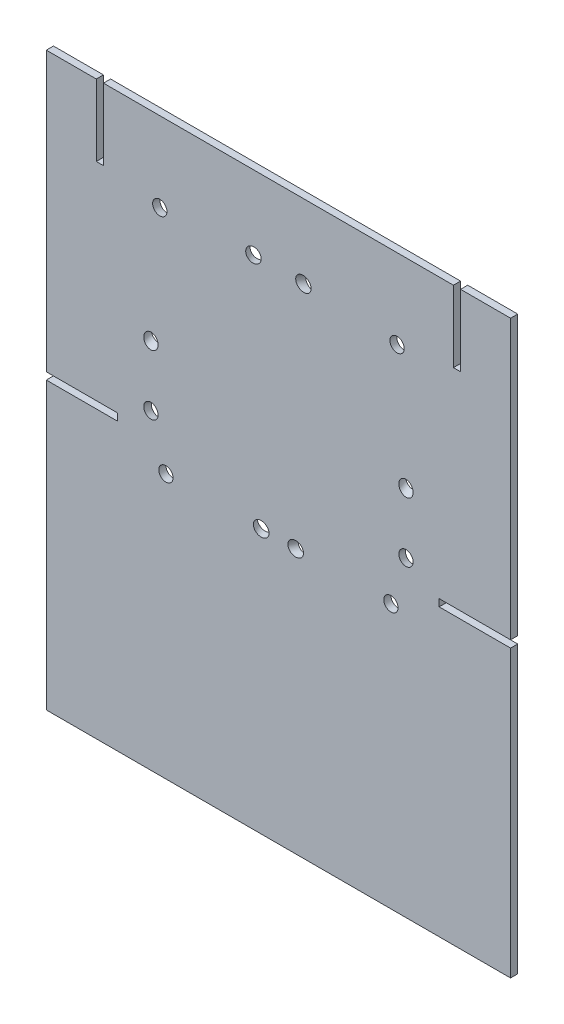
ISO-10303-21;
HEADER;
FILE_DESCRIPTION(('STEP AP214'),'2;1');
FILE_NAME('part.step','',(''),(''),'','','');
FILE_SCHEMA(('AUTOMOTIVE_DESIGN { 1 0 10303 214 1 1 1 1 }'));
ENDSEC;
DATA;
#1=APPLICATION_CONTEXT('core data for automotive mechanical design processes');
#2=APPLICATION_PROTOCOL_DEFINITION('international standard','automotive_design',2000,#1);
#3=PRODUCT_CONTEXT('',#1,'mechanical');
#4=PRODUCT('Part','Part','',(#3));
#5=PRODUCT_RELATED_PRODUCT_CATEGORY('part','',(#4));
#6=PRODUCT_DEFINITION_FORMATION('','',#4);
#7=PRODUCT_DEFINITION_CONTEXT('part definition',#1,'design');
#8=PRODUCT_DEFINITION('design','',#6,#7);
#9=PRODUCT_DEFINITION_SHAPE('','',#8);
#10=(LENGTH_UNIT() NAMED_UNIT(*) SI_UNIT(.MILLI.,.METRE.));
#11=(NAMED_UNIT(*) PLANE_ANGLE_UNIT() SI_UNIT($,.RADIAN.));
#12=(NAMED_UNIT(*) SI_UNIT($,.STERADIAN.) SOLID_ANGLE_UNIT());
#13=UNCERTAINTY_MEASURE_WITH_UNIT(LENGTH_MEASURE(1.E-05),#10,'distance_accuracy_value','');
#14=(GEOMETRIC_REPRESENTATION_CONTEXT(3) GLOBAL_UNCERTAINTY_ASSIGNED_CONTEXT((#13)) GLOBAL_UNIT_ASSIGNED_CONTEXT((#10,
#11,#12)) REPRESENTATION_CONTEXT('',''));
#15=CARTESIAN_POINT('',(0.,0.,0.));
#16=DIRECTION('',(0.,0.,1.));
#17=DIRECTION('',(1.,0.,0.));
#18=AXIS2_PLACEMENT_3D('',#15,#16,#17);
#19=CARTESIAN_POINT('',(-412.75,508.,6.35));
#20=DIRECTION('',(0.,-1.,0.));
#21=DIRECTION('',(1.,0.,0.));
#22=AXIS2_PLACEMENT_3D('',#19,#20,#21);
#23=PLANE('',#22);
#24=DIRECTION('',(-1.,0.,0.));
#25=VECTOR('',#24,1.);
#26=CARTESIAN_POINT('',(-412.75,508.,-6.35));
#27=LINE('',#26,#25);
#28=CARTESIAN_POINT('',(311.150000000003,507.999999999998,-6.35));
#29=VERTEX_POINT('',#28);
#30=CARTESIAN_POINT('',(-311.15,508.,-6.35));
#31=VERTEX_POINT('',#30);
#32=EDGE_CURVE('E414',#29,#31,#27,.T.);
#33=ORIENTED_EDGE('',*,*,#32,.T.);
#34=DIRECTION('',(0.,0.,-1.));
#35=VECTOR('',#34,1.);
#36=CARTESIAN_POINT('',(-311.15,508.,6.35000000000002));
#37=LINE('',#36,#35);
#38=CARTESIAN_POINT('',(-311.15,508.,6.35000000000002));
#39=VERTEX_POINT('',#38);
#40=EDGE_CURVE('E225',#39,#31,#37,.T.);
#41=ORIENTED_EDGE('',*,*,#40,.F.);
#42=DIRECTION('',(-1.,0.,0.));
#43=VECTOR('',#42,1.);
#44=CARTESIAN_POINT('',(-412.75,508.,6.35));
#45=LINE('',#44,#43);
#46=CARTESIAN_POINT('',(311.150000000003,507.999999999998,6.35000000000002));
#47=VERTEX_POINT('',#46);
#48=EDGE_CURVE('E211',#47,#39,#45,.T.);
#49=ORIENTED_EDGE('',*,*,#48,.F.);
#50=DIRECTION('',(0.,0.,-1.));
#51=VECTOR('',#50,1.);
#52=CARTESIAN_POINT('',(311.150000000003,507.999999999998,6.35000000000002));
#53=LINE('',#52,#51);
#54=EDGE_CURVE('E234',#47,#29,#53,.T.);
#55=ORIENTED_EDGE('',*,*,#54,.T.);
#56=EDGE_LOOP('',(#33,#41,#49,#55));
#57=FACE_BOUND('',#56,.T.);
#58=ADVANCED_FACE('F45',(#57),#23,.F.);
#59=CARTESIAN_POINT('',(-323.85,508.,6.35000000000002));
#60=VERTEX_POINT('',#59);
#61=CARTESIAN_POINT('',(-412.75,508.,6.35));
#62=VERTEX_POINT('',#61);
#63=EDGE_CURVE('E429',#60,#62,#45,.T.);
#64=ORIENTED_EDGE('',*,*,#63,.F.);
#65=DIRECTION('',(0.,0.,-1.));
#66=VECTOR('',#65,1.);
#67=CARTESIAN_POINT('',(-323.85,508.,6.35000000000002));
#68=LINE('',#67,#66);
#69=CARTESIAN_POINT('',(-323.85,508.,-6.35));
#70=VERTEX_POINT('',#69);
#71=EDGE_CURVE('E229',#60,#70,#68,.T.);
#72=ORIENTED_EDGE('',*,*,#71,.T.);
#73=CARTESIAN_POINT('',(-412.75,508.,-6.35));
#74=VERTEX_POINT('',#73);
#75=EDGE_CURVE('E404',#70,#74,#27,.T.);
#76=ORIENTED_EDGE('',*,*,#75,.T.);
#77=DIRECTION('',(0.,0.,-1.));
#78=VECTOR('',#77,1.);
#79=CARTESIAN_POINT('',(-412.75,508.,6.35));
#80=LINE('',#79,#78);
#81=EDGE_CURVE('E390',#62,#74,#80,.T.);
#82=ORIENTED_EDGE('',*,*,#81,.F.);
#83=EDGE_LOOP('',(#64,#72,#76,#82));
#84=FACE_BOUND('',#83,.T.);
#85=ADVANCED_FACE('F575',(#84),#23,.F.);
#86=CARTESIAN_POINT('',(412.75,508.,6.35));
#87=DIRECTION('',(-1.,0.,0.));
#88=DIRECTION('',(0.,-1.,0.));
#89=AXIS2_PLACEMENT_3D('',#86,#87,#88);
#90=PLANE('',#89);
#91=DIRECTION('',(0.,0.,-1.));
#92=VECTOR('',#91,1.);
#93=CARTESIAN_POINT('',(412.75,12.6999999999955,6.35000000000002));
#94=LINE('',#93,#92);
#95=CARTESIAN_POINT('',(412.75,12.6999999999955,6.35000000000002));
#96=VERTEX_POINT('',#95);
#97=CARTESIAN_POINT('',(412.75,12.6999999999955,-6.35));
#98=VERTEX_POINT('',#97);
#99=EDGE_CURVE('E228',#96,#98,#94,.T.);
#100=ORIENTED_EDGE('',*,*,#99,.T.);
#101=DIRECTION('',(0.,1.,0.));
#102=VECTOR('',#101,1.);
#103=CARTESIAN_POINT('',(412.75,508.,-6.35));
#104=LINE('',#103,#102);
#105=CARTESIAN_POINT('',(412.75,508.,-6.35));
#106=VERTEX_POINT('',#105);
#107=EDGE_CURVE('E303',#98,#106,#104,.T.);
#108=ORIENTED_EDGE('',*,*,#107,.T.);
#109=DIRECTION('',(0.,0.,-1.));
#110=VECTOR('',#109,1.);
#111=CARTESIAN_POINT('',(412.75,508.,6.35));
#112=LINE('',#111,#110);
#113=CARTESIAN_POINT('',(412.75,508.,6.35));
#114=VERTEX_POINT('',#113);
#115=EDGE_CURVE('E384',#114,#106,#112,.T.);
#116=ORIENTED_EDGE('',*,*,#115,.F.);
#117=DIRECTION('',(0.,1.,0.));
#118=VECTOR('',#117,1.);
#119=CARTESIAN_POINT('',(412.75,508.,6.35));
#120=LINE('',#119,#118);
#121=EDGE_CURVE('E434',#96,#114,#120,.T.);
#122=ORIENTED_EDGE('',*,*,#121,.F.);
#123=EDGE_LOOP('',(#100,#108,#116,#122));
#124=FACE_BOUND('',#123,.T.);
#125=ADVANCED_FACE('F531',(#124),#90,.F.);
#126=CARTESIAN_POINT('',(-412.75,508.,6.35));
#127=DIRECTION('',(1.,0.,0.));
#128=DIRECTION('',(0.,1.,0.));
#129=AXIS2_PLACEMENT_3D('',#126,#127,#128);
#130=PLANE('',#129);
#131=DIRECTION('',(0.,0.,-1.));
#132=VECTOR('',#131,1.);
#133=CARTESIAN_POINT('',(-412.75,2.22044604925031E-13,6.35000000000002));
#134=LINE('',#133,#132);
#135=CARTESIAN_POINT('',(-412.75,2.22044604925031E-13,6.35000000000002));
#136=VERTEX_POINT('',#135);
#137=CARTESIAN_POINT('',(-412.75,2.22044604925031E-13,-6.35));
#138=VERTEX_POINT('',#137);
#139=EDGE_CURVE('E299',#136,#138,#134,.T.);
#140=ORIENTED_EDGE('',*,*,#139,.T.);
#141=DIRECTION('',(0.,-1.,0.));
#142=VECTOR('',#141,1.);
#143=CARTESIAN_POINT('',(-412.75,508.,-6.35));
#144=LINE('',#143,#142);
#145=CARTESIAN_POINT('',(-412.75,-508.,-6.35));
#146=VERTEX_POINT('',#145);
#147=EDGE_CURVE('E388',#138,#146,#144,.T.);
#148=ORIENTED_EDGE('',*,*,#147,.T.);
#149=DIRECTION('',(0.,0.,-1.));
#150=VECTOR('',#149,1.);
#151=CARTESIAN_POINT('',(-412.75,-508.,6.35));
#152=LINE('',#151,#150);
#153=CARTESIAN_POINT('',(-412.75,-508.,6.35));
#154=VERTEX_POINT('',#153);
#155=EDGE_CURVE('E396',#154,#146,#152,.T.);
#156=ORIENTED_EDGE('',*,*,#155,.F.);
#157=DIRECTION('',(0.,-1.,0.));
#158=VECTOR('',#157,1.);
#159=CARTESIAN_POINT('',(-412.75,508.,6.35));
#160=LINE('',#159,#158);
#161=EDGE_CURVE('E424',#136,#154,#160,.T.);
#162=ORIENTED_EDGE('',*,*,#161,.F.);
#163=EDGE_LOOP('',(#140,#148,#156,#162));
#164=FACE_BOUND('',#163,.T.);
#165=ADVANCED_FACE('F567',(#164),#130,.F.);
#166=CARTESIAN_POINT('',(0.,0.,6.35));
#167=DIRECTION('',(0.,0.,1.));
#168=DIRECTION('',(1.,0.,0.));
#169=AXIS2_PLACEMENT_3D('',#166,#167,#168);
#170=PLANE('',#169);
#171=DIRECTION('',(0.,-1.,0.));
#172=VECTOR('',#171,1.);
#173=CARTESIAN_POINT('',(-311.15,508.,6.35000000000002));
#174=LINE('',#173,#172);
#175=CARTESIAN_POINT('',(-311.15,381.,6.35000000000002));
#176=VERTEX_POINT('',#175);
#177=EDGE_CURVE('E188',#39,#176,#174,.T.);
#178=ORIENTED_EDGE('',*,*,#177,.T.);
#179=DIRECTION('',(-1.,0.,0.));
#180=VECTOR('',#179,1.);
#181=CARTESIAN_POINT('',(-311.15,381.,6.35000000000002));
#182=LINE('',#181,#180);
#183=CARTESIAN_POINT('',(-323.85,381.,6.35000000000002));
#184=VERTEX_POINT('',#183);
#185=EDGE_CURVE('E200',#176,#184,#182,.T.);
#186=ORIENTED_EDGE('',*,*,#185,.T.);
#187=DIRECTION('',(0.,1.,0.));
#188=VECTOR('',#187,1.);
#189=CARTESIAN_POINT('',(-323.85,508.,6.35000000000002));
#190=LINE('',#189,#188);
#191=EDGE_CURVE('E197',#184,#60,#190,.T.);
#192=ORIENTED_EDGE('',*,*,#191,.T.);
#193=ORIENTED_EDGE('',*,*,#63,.T.);
#194=CARTESIAN_POINT('',(-412.75,12.6999999999982,6.35000000000002));
#195=VERTEX_POINT('',#194);
#196=EDGE_CURVE('E420',#62,#195,#160,.T.);
#197=ORIENTED_EDGE('',*,*,#196,.T.);
#198=DIRECTION('',(1.,0.,0.));
#199=VECTOR('',#198,1.);
#200=CARTESIAN_POINT('',(-412.75,12.6999999999982,6.35000000000002));
#201=LINE('',#200,#199);
#202=CARTESIAN_POINT('',(-285.75,12.6999999999982,6.35000000000002));
#203=VERTEX_POINT('',#202);
#204=EDGE_CURVE('E274',#195,#203,#201,.T.);
#205=ORIENTED_EDGE('',*,*,#204,.T.);
#206=DIRECTION('',(0.,-1.,0.));
#207=VECTOR('',#206,1.);
#208=CARTESIAN_POINT('',(-285.75,12.6999999999982,6.35000000000002));
#209=LINE('',#208,#207);
#210=CARTESIAN_POINT('',(-285.75,0.,6.35000000000002));
#211=VERTEX_POINT('',#210);
#212=EDGE_CURVE('E269',#203,#211,#209,.T.);
#213=ORIENTED_EDGE('',*,*,#212,.T.);
#214=DIRECTION('',(1.,0.,0.));
#215=VECTOR('',#214,1.);
#216=CARTESIAN_POINT('',(-412.75,2.22044604925031E-13,6.35000000000002));
#217=LINE('',#216,#215);
#218=EDGE_CURVE('E266',#136,#211,#217,.T.);
#219=ORIENTED_EDGE('',*,*,#218,.F.);
#220=ORIENTED_EDGE('',*,*,#161,.T.);
#221=DIRECTION('',(1.,0.,0.));
#222=VECTOR('',#221,1.);
#223=CARTESIAN_POINT('',(-412.75,-508.,6.35));
#224=LINE('',#223,#222);
#225=CARTESIAN_POINT('',(412.75,-508.,6.35));
#226=VERTEX_POINT('',#225);
#227=EDGE_CURVE('E383',#154,#226,#224,.T.);
#228=ORIENTED_EDGE('',*,*,#227,.T.);
#229=CARTESIAN_POINT('',(412.75,-2.66453525910038E-12,6.35000000000002));
#230=VERTEX_POINT('',#229);
#231=EDGE_CURVE('E430',#226,#230,#120,.T.);
#232=ORIENTED_EDGE('',*,*,#231,.T.);
#233=DIRECTION('',(-1.,0.,0.));
#234=VECTOR('',#233,1.);
#235=CARTESIAN_POINT('',(412.75,-2.66453525910038E-12,6.35000000000002));
#236=LINE('',#235,#234);
#237=CARTESIAN_POINT('',(285.75,-2.01395445867445E-12,6.35000000000002));
#238=VERTEX_POINT('',#237);
#239=EDGE_CURVE('E322',#230,#238,#236,.T.);
#240=ORIENTED_EDGE('',*,*,#239,.T.);
#241=DIRECTION('',(0.,-1.,0.));
#242=VECTOR('',#241,1.);
#243=CARTESIAN_POINT('',(285.75,12.6999999999964,6.35000000000002));
#244=LINE('',#243,#242);
#245=CARTESIAN_POINT('',(285.75,12.6999999999964,6.35000000000002));
#246=VERTEX_POINT('',#245);
#247=EDGE_CURVE('E331',#246,#238,#244,.T.);
#248=ORIENTED_EDGE('',*,*,#247,.F.);
#249=DIRECTION('',(-1.,0.,0.));
#250=VECTOR('',#249,1.);
#251=CARTESIAN_POINT('',(412.75,12.6999999999955,6.35000000000002));
#252=LINE('',#251,#250);
#253=EDGE_CURVE('E307',#96,#246,#252,.T.);
#254=ORIENTED_EDGE('',*,*,#253,.F.);
#255=ORIENTED_EDGE('',*,*,#121,.T.);
#256=CARTESIAN_POINT('',(323.850000000003,508.,6.35));
#257=VERTEX_POINT('',#256);
#258=EDGE_CURVE('E425',#114,#257,#45,.T.);
#259=ORIENTED_EDGE('',*,*,#258,.T.);
#260=DIRECTION('',(0.,-1.,0.));
#261=VECTOR('',#260,1.);
#262=CARTESIAN_POINT('',(323.850000000003,507.999999999998,6.35000000000002));
#263=LINE('',#262,#261);
#264=CARTESIAN_POINT('',(323.850000000003,380.999999999998,6.35000000000002));
#265=VERTEX_POINT('',#264);
#266=EDGE_CURVE('E63',#257,#265,#263,.T.);
#267=ORIENTED_EDGE('',*,*,#266,.T.);
#268=DIRECTION('',(-1.,0.,0.));
#269=VECTOR('',#268,1.);
#270=CARTESIAN_POINT('',(311.150000000003,380.999999999998,6.35000000000002));
#271=LINE('',#270,#269);
#272=CARTESIAN_POINT('',(311.150000000003,380.999999999998,6.35000000000002));
#273=VERTEX_POINT('',#272);
#274=EDGE_CURVE('E238',#265,#273,#271,.T.);
#275=ORIENTED_EDGE('',*,*,#274,.T.);
#276=DIRECTION('',(0.,1.,0.));
#277=VECTOR('',#276,1.);
#278=CARTESIAN_POINT('',(311.150000000003,507.999999999998,6.35000000000002));
#279=LINE('',#278,#277);
#280=EDGE_CURVE('E253',#273,#47,#279,.T.);
#281=ORIENTED_EDGE('',*,*,#280,.T.);
#282=ORIENTED_EDGE('',*,*,#48,.T.);
#283=EDGE_LOOP('',(#178,#186,#192,#193,#197,#205,#213,#219,#220,#228,#232,#240,#248,#254,#255,
#259,#267,#275,#281,#282));
#284=FACE_BOUND('',#283,.T.);
#285=CARTESIAN_POINT('',(-200.,-38.0999999999997,6.34999999999997));
#286=DIRECTION('',(0.,0.,1.));
#287=DIRECTION('',(1.,0.,0.));
#288=AXIS2_PLACEMENT_3D('',#285,#286,#287);
#289=CIRCLE('',#288,12.7);
#290=CARTESIAN_POINT('',(-187.3,-38.0999999999997,6.34999999999997));
#291=VERTEX_POINT('',#290);
#292=EDGE_CURVE('E49',#291,#291,#289,.F.);
#293=ORIENTED_EDGE('',*,*,#292,.T.);
#294=EDGE_LOOP('',(#293));
#295=FACE_BOUND('',#294,.T.);
#296=CARTESIAN_POINT('',(-226.738278646609,45.742927735187,6.35000000000002));
#297=DIRECTION('',(0.,0.,1.));
#298=DIRECTION('',(-0.303832853142546,0.95272535252887,0.));
#299=AXIS2_PLACEMENT_3D('',#296,#297,#298);
#300=ELLIPSE('',#299,13.0343806943275,12.7);
#301=CARTESIAN_POINT('',(-230.698551721913,58.1611126771857,6.35000000000002));
#302=VERTEX_POINT('',#301);
#303=EDGE_CURVE('E354',#302,#302,#300,.F.);
#304=ORIENTED_EDGE('',*,*,#303,.T.);
#305=EDGE_LOOP('',(#304));
#306=FACE_BOUND('',#305,.T.);
#307=CARTESIAN_POINT('',(200.000000000002,-38.0999999999998,6.35000000000002));
#308=DIRECTION('',(0.,0.,1.));
#309=DIRECTION('',(1.,0.,0.));
#310=AXIS2_PLACEMENT_3D('',#307,#308,#309);
#311=CIRCLE('',#310,12.7);
#312=CARTESIAN_POINT('',(212.700000000002,-38.0999999999998,6.35000000000002));
#313=VERTEX_POINT('',#312);
#314=EDGE_CURVE('E350',#313,#313,#311,.F.);
#315=ORIENTED_EDGE('',*,*,#314,.T.);
#316=EDGE_LOOP('',(#315));
#317=FACE_BOUND('',#316,.T.);
#318=CARTESIAN_POINT('',(226.738278646599,45.742927735198,6.35000000000002));
#319=DIRECTION('',(0.,0.,1.));
#320=DIRECTION('',(0.303832853142368,0.952725352528927,0.));
#321=AXIS2_PLACEMENT_3D('',#318,#319,#320);
#322=ELLIPSE('',#321,13.0343806943275,12.7);
#323=CARTESIAN_POINT('',(230.6985517219,58.1611126771975,6.35000000000002));
#324=VERTEX_POINT('',#323);
#325=EDGE_CURVE('E346',#324,#324,#322,.F.);
#326=ORIENTED_EDGE('',*,*,#325,.T.);
#327=EDGE_LOOP('',(#326));
#328=FACE_BOUND('',#327,.T.);
#329=CARTESIAN_POINT('',(210.931171426476,366.455479351303,6.35000000000002));
#330=DIRECTION('',(0.,0.,1.));
#331=DIRECTION('',(0.196463058124641,0.980511227264795,0.));
#332=AXIS2_PLACEMENT_3D('',#329,#330,#331);
#333=ELLIPSE('',#332,12.8347094862159,12.7);
#334=CARTESIAN_POINT('',(213.452717702279,379.04005610122,6.35000000000002));
#335=VERTEX_POINT('',#334);
#336=EDGE_CURVE('E342',#335,#335,#333,.F.);
#337=ORIENTED_EDGE('',*,*,#336,.T.);
#338=EDGE_LOOP('',(#337));
#339=FACE_BOUND('',#338,.T.);
#340=CARTESIAN_POINT('',(-210.931171426473,366.455479351302,6.34999999999997));
#341=DIRECTION('',(0.,0.,1.));
#342=DIRECTION('',(0.19646305812471,-0.980511227264781,0.));
#343=AXIS2_PLACEMENT_3D('',#340,#341,#342);
#344=ELLIPSE('',#343,12.8347094862159,12.7);
#345=CARTESIAN_POINT('',(-208.409625150669,353.870902601385,6.34999999999997));
#346=VERTEX_POINT('',#345);
#347=EDGE_CURVE('E337',#346,#346,#344,.F.);
#348=ORIENTED_EDGE('',*,*,#347,.T.);
#349=EDGE_LOOP('',(#348));
#350=FACE_BOUND('',#349,.T.);
#351=CARTESIAN_POINT('',(226.738278646599,153.183977553133,6.35000000000002));
#352=DIRECTION('',(0.,0.,1.));
#353=DIRECTION('',(0.166125263951469,-0.98610465807492,0.));
#354=AXIS2_PLACEMENT_3D('',#351,#352,#353);
#355=ELLIPSE('',#354,13.7867372389529,12.7);
#356=CARTESIAN_POINT('',(229.028604009449,139.588811742146,6.35000000000002));
#357=VERTEX_POINT('',#356);
#358=EDGE_CURVE('E341',#357,#357,#355,.F.);
#359=ORIENTED_EDGE('',*,*,#358,.T.);
#360=EDGE_LOOP('',(#359));
#361=FACE_BOUND('',#360,.T.);
#362=CARTESIAN_POINT('',(-226.738278646608,153.183977553121,6.35000000000002));
#363=DIRECTION('',(0.,0.,1.));
#364=DIRECTION('',(-0.166125263951556,-0.986104658074905,0.));
#365=AXIS2_PLACEMENT_3D('',#362,#363,#364);
#366=ELLIPSE('',#365,13.7867372389531,12.7);
#367=CARTESIAN_POINT('',(-229.02860400946,139.588811742135,6.35000000000002));
#368=VERTEX_POINT('',#367);
#369=EDGE_CURVE('E438',#368,#368,#366,.F.);
#370=ORIENTED_EDGE('',*,*,#369,.T.);
#371=EDGE_LOOP('',(#370));
#372=FACE_BOUND('',#371,.T.);
#373=CARTESIAN_POINT('',(-44.4461666666638,376.690974591494,6.35000000000002));
#374=DIRECTION('',(0.,0.,1.));
#375=DIRECTION('',(0.923125632822931,0.384498460367872,0.));
#376=AXIS2_PLACEMENT_3D('',#373,#374,#375);
#377=ELLIPSE('',#376,13.8866788867449,12.7);
#378=CARTESIAN_POINT('',(-31.6270174315286,382.03038124307,6.35000000000002));
#379=VERTEX_POINT('',#378);
#380=EDGE_CURVE('E442',#379,#379,#377,.F.);
#381=ORIENTED_EDGE('',*,*,#380,.T.);
#382=EDGE_LOOP('',(#381));
#383=FACE_BOUND('',#382,.T.);
#384=CARTESIAN_POINT('',(44.446166666669,376.690974591494,6.34999999999997));
#385=DIRECTION('',(0.,0.,1.));
#386=DIRECTION('',(0.923125632822932,-0.384498460367868,0.));
#387=AXIS2_PLACEMENT_3D('',#384,#385,#386);
#388=ELLIPSE('',#387,13.8866788867449,12.7);
#389=CARTESIAN_POINT('',(57.2653159018043,371.351567939917,6.34999999999997));
#390=VERTEX_POINT('',#389);
#391=EDGE_CURVE('E446',#390,#390,#388,.F.);
#392=ORIENTED_EDGE('',*,*,#391,.T.);
#393=EDGE_LOOP('',(#392));
#394=FACE_BOUND('',#393,.T.);
#395=CARTESIAN_POINT('',(-30.6666666666667,-38.0999999999998,6.35000000000002));
#396=DIRECTION('',(0.,0.,1.));
#397=DIRECTION('',(1.,0.,0.));
#398=AXIS2_PLACEMENT_3D('',#395,#396,#397);
#399=ELLIPSE('',#398,13.8978326758678,12.7);
#400=CARTESIAN_POINT('',(-16.7688339907989,-38.0999999999998,6.35000000000002));
#401=VERTEX_POINT('',#400);
#402=EDGE_CURVE('E450',#401,#401,#399,.F.);
#403=ORIENTED_EDGE('',*,*,#402,.T.);
#404=EDGE_LOOP('',(#403));
#405=FACE_BOUND('',#404,.T.);
#406=CARTESIAN_POINT('',(30.6666666666675,-38.0999999999997,6.34999999999997));
#407=DIRECTION('',(0.,0.,1.));
#408=DIRECTION('',(1.,0.,0.));
#409=AXIS2_PLACEMENT_3D('',#406,#407,#408);
#410=ELLIPSE('',#409,13.8978326758679,12.7);
#411=CARTESIAN_POINT('',(44.5644993425353,-38.0999999999997,6.34999999999997));
#412=VERTEX_POINT('',#411);
#413=EDGE_CURVE('E454',#412,#412,#410,.F.);
#414=ORIENTED_EDGE('',*,*,#413,.T.);
#415=EDGE_LOOP('',(#414));
#416=FACE_BOUND('',#415,.T.);
#417=ADVANCED_FACE('F47',(#284,#295,#306,#317,#328,#339,#350,#361,#372,#383,#394,#405,#416),
#170,.T.);
#418=CARTESIAN_POINT('',(0.,0.,-6.35));
#419=DIRECTION('',(0.,0.,1.));
#420=DIRECTION('',(1.,0.,0.));
#421=AXIS2_PLACEMENT_3D('',#418,#419,#420);
#422=PLANE('',#421);
#423=CARTESIAN_POINT('',(-200.,-38.0999999999997,-6.34999999999997));
#424=DIRECTION('',(0.,0.,1.));
#425=DIRECTION('',(1.,0.,0.));
#426=AXIS2_PLACEMENT_3D('',#423,#424,#425);
#427=CIRCLE('',#426,12.7);
#428=CARTESIAN_POINT('',(-187.3,-38.0999999999997,-6.34999999999997));
#429=VERTEX_POINT('',#428);
#430=EDGE_CURVE('E11',#429,#429,#427,.F.);
#431=ORIENTED_EDGE('',*,*,#430,.F.);
#432=EDGE_LOOP('',(#431));
#433=FACE_BOUND('',#432,.T.);
#434=CARTESIAN_POINT('',(-225.847002691722,42.9481634773474,-6.35000000000002));
#435=DIRECTION('',(0.,0.,1.));
#436=DIRECTION('',(-0.303832853142546,0.95272535252887,0.));
#437=AXIS2_PLACEMENT_3D('',#434,#435,#436);
#438=ELLIPSE('',#437,13.0343806943275,12.7);
#439=CARTESIAN_POINT('',(-229.807275767026,55.3663484193461,-6.35000000000002));
#440=VERTEX_POINT('',#439);
#441=EDGE_CURVE('E55',#440,#440,#438,.F.);
#442=ORIENTED_EDGE('',*,*,#441,.F.);
#443=EDGE_LOOP('',(#442));
#444=FACE_BOUND('',#443,.T.);
#445=CARTESIAN_POINT('',(200.000000000002,-38.0999999999998,-6.35000000000002));
#446=DIRECTION('',(0.,0.,1.));
#447=DIRECTION('',(1.,0.,0.));
#448=AXIS2_PLACEMENT_3D('',#445,#446,#447);
#449=CIRCLE('',#448,12.7);
#450=CARTESIAN_POINT('',(212.700000000002,-38.0999999999998,-6.35000000000002));
#451=VERTEX_POINT('',#450);
#452=EDGE_CURVE('E469',#451,#451,#449,.F.);
#453=ORIENTED_EDGE('',*,*,#452,.F.);
#454=EDGE_LOOP('',(#453));
#455=FACE_BOUND('',#454,.T.);
#456=CARTESIAN_POINT('',(225.847002691712,42.9481634773581,-6.35000000000002));
#457=DIRECTION('',(0.,0.,1.));
#458=DIRECTION('',(0.303832853142368,0.952725352528927,0.));
#459=AXIS2_PLACEMENT_3D('',#456,#457,#458);
#460=ELLIPSE('',#459,13.0343806943275,12.7);
#461=CARTESIAN_POINT('',(229.807275767014,55.3663484193575,-6.35000000000002));
#462=VERTEX_POINT('',#461);
#463=EDGE_CURVE('E465',#462,#462,#460,.F.);
#464=ORIENTED_EDGE('',*,*,#463,.F.);
#465=EDGE_LOOP('',(#464));
#466=FACE_BOUND('',#465,.T.);
#467=CARTESIAN_POINT('',(210.566799045594,364.636963372926,-6.35000000000002));
#468=DIRECTION('',(0.,0.,1.));
#469=DIRECTION('',(0.196463058124641,0.980511227264795,0.));
#470=AXIS2_PLACEMENT_3D('',#467,#468,#469);
#471=ELLIPSE('',#470,12.8347094862159,12.7);
#472=CARTESIAN_POINT('',(213.088345321397,377.221540122843,-6.35000000000002));
#473=VERTEX_POINT('',#472);
#474=EDGE_CURVE('E461',#473,#473,#471,.F.);
#475=ORIENTED_EDGE('',*,*,#474,.F.);
#476=EDGE_LOOP('',(#475));
#477=FACE_BOUND('',#476,.T.);
#478=CARTESIAN_POINT('',(-210.56679904559,364.636963372925,-6.34999999999997));
#479=DIRECTION('',(0.,0.,1.));
#480=DIRECTION('',(0.19646305812471,-0.980511227264781,0.));
#481=AXIS2_PLACEMENT_3D('',#478,#479,#480);
#482=ELLIPSE('',#481,12.8347094862159,12.7);
#483=CARTESIAN_POINT('',(-208.045252769786,352.052386623009,-6.34999999999997));
#484=VERTEX_POINT('',#483);
#485=EDGE_CURVE('E362',#484,#484,#482,.F.);
#486=ORIENTED_EDGE('',*,*,#485,.F.);
#487=EDGE_LOOP('',(#486));
#488=FACE_BOUND('',#487,.T.);
#489=CARTESIAN_POINT('',(225.847002691712,158.474511634695,-6.35000000000002));
#490=DIRECTION('',(0.,0.,1.));
#491=DIRECTION('',(0.166125263951469,-0.98610465807492,0.));
#492=AXIS2_PLACEMENT_3D('',#489,#490,#491);
#493=ELLIPSE('',#492,13.7867372389529,12.7);
#494=CARTESIAN_POINT('',(228.137328054563,144.879345823708,-6.35000000000002));
#495=VERTEX_POINT('',#494);
#496=EDGE_CURVE('E358',#495,#495,#493,.F.);
#497=ORIENTED_EDGE('',*,*,#496,.F.);
#498=EDGE_LOOP('',(#497));
#499=FACE_BOUND('',#498,.T.);
#500=CARTESIAN_POINT('',(-225.847002691721,158.474511634684,-6.35000000000002));
#501=DIRECTION('',(0.,0.,1.));
#502=DIRECTION('',(-0.166125263951556,-0.986104658074905,0.));
#503=AXIS2_PLACEMENT_3D('',#500,#501,#502);
#504=ELLIPSE('',#503,13.7867372389531,12.7);
#505=CARTESIAN_POINT('',(-228.137328054573,144.879345823697,-6.35000000000002));
#506=VERTEX_POINT('',#505);
#507=EDGE_CURVE('E363',#506,#506,#504,.F.);
#508=ORIENTED_EDGE('',*,*,#507,.F.);
#509=EDGE_LOOP('',(#508));
#510=FACE_BOUND('',#509,.T.);
#511=CARTESIAN_POINT('',(-49.6312944444416,374.531275438444,-6.35000000000002));
#512=DIRECTION('',(0.,0.,1.));
#513=DIRECTION('',(0.923125632822931,0.384498460367872,0.));
#514=AXIS2_PLACEMENT_3D('',#511,#512,#513);
#515=ELLIPSE('',#514,13.8866788867449,12.7);
#516=CARTESIAN_POINT('',(-36.8121452093064,379.87068209002,-6.35000000000002));
#517=VERTEX_POINT('',#516);
#518=EDGE_CURVE('E367',#517,#517,#515,.F.);
#519=ORIENTED_EDGE('',*,*,#518,.F.);
#520=EDGE_LOOP('',(#519));
#521=FACE_BOUND('',#520,.T.);
#522=CARTESIAN_POINT('',(49.6312944444468,374.531275438444,-6.34999999999997));
#523=DIRECTION('',(0.,0.,1.));
#524=DIRECTION('',(0.923125632822932,-0.384498460367868,0.));
#525=AXIS2_PLACEMENT_3D('',#522,#523,#524);
#526=ELLIPSE('',#525,13.8866788867449,12.7);
#527=CARTESIAN_POINT('',(62.4504436795821,369.191868786867,-6.34999999999997));
#528=VERTEX_POINT('',#527);
#529=EDGE_CURVE('E371',#528,#528,#526,.F.);
#530=ORIENTED_EDGE('',*,*,#529,.F.);
#531=EDGE_LOOP('',(#530));
#532=FACE_BOUND('',#531,.T.);
#533=CARTESIAN_POINT('',(-36.3111111111112,-38.0999999999998,-6.35000000000002));
#534=DIRECTION('',(0.,0.,1.));
#535=DIRECTION('',(1.,0.,0.));
#536=AXIS2_PLACEMENT_3D('',#533,#534,#535);
#537=ELLIPSE('',#536,13.8978326758678,12.7);
#538=CARTESIAN_POINT('',(-22.4132784352433,-38.0999999999998,-6.35000000000002));
#539=VERTEX_POINT('',#538);
#540=EDGE_CURVE('E375',#539,#539,#537,.F.);
#541=ORIENTED_EDGE('',*,*,#540,.F.);
#542=EDGE_LOOP('',(#541));
#543=FACE_BOUND('',#542,.T.);
#544=CARTESIAN_POINT('',(36.311111111112,-38.0999999999997,-6.34999999999997));
#545=DIRECTION('',(0.,0.,1.));
#546=DIRECTION('',(1.,0.,0.));
#547=AXIS2_PLACEMENT_3D('',#544,#545,#546);
#548=ELLIPSE('',#547,13.8978326758679,12.7);
#549=CARTESIAN_POINT('',(50.2089437869798,-38.0999999999997,-6.34999999999997));
#550=VERTEX_POINT('',#549);
#551=EDGE_CURVE('E379',#550,#550,#548,.F.);
#552=ORIENTED_EDGE('',*,*,#551,.F.);
#553=EDGE_LOOP('',(#552));
#554=FACE_BOUND('',#553,.T.);
#555=DIRECTION('',(-1.,0.,0.));
#556=VECTOR('',#555,1.);
#557=CARTESIAN_POINT('',(-311.15,381.,-6.35));
#558=LINE('',#557,#556);
#559=CARTESIAN_POINT('',(-311.15,381.,-6.35));
#560=VERTEX_POINT('',#559);
#561=CARTESIAN_POINT('',(-323.85,381.,-6.35));
#562=VERTEX_POINT('',#561);
#563=EDGE_CURVE('E215',#560,#562,#558,.T.);
#564=ORIENTED_EDGE('',*,*,#563,.F.);
#565=DIRECTION('',(0.,-1.,0.));
#566=VECTOR('',#565,1.);
#567=CARTESIAN_POINT('',(-311.15,508.,-6.35));
#568=LINE('',#567,#566);
#569=EDGE_CURVE('E191',#31,#560,#568,.T.);
#570=ORIENTED_EDGE('',*,*,#569,.F.);
#571=ORIENTED_EDGE('',*,*,#32,.F.);
#572=DIRECTION('',(0.,1.,0.));
#573=VECTOR('',#572,1.);
#574=CARTESIAN_POINT('',(311.150000000003,507.999999999998,-6.35));
#575=LINE('',#574,#573);
#576=CARTESIAN_POINT('',(311.150000000003,380.999999999998,-6.35));
#577=VERTEX_POINT('',#576);
#578=EDGE_CURVE('E222',#577,#29,#575,.T.);
#579=ORIENTED_EDGE('',*,*,#578,.F.);
#580=DIRECTION('',(-1.,0.,0.));
#581=VECTOR('',#580,1.);
#582=CARTESIAN_POINT('',(311.150000000003,380.999999999998,-6.35));
#583=LINE('',#582,#581);
#584=CARTESIAN_POINT('',(323.850000000003,380.999999999998,-6.35));
#585=VERTEX_POINT('',#584);
#586=EDGE_CURVE('E248',#585,#577,#583,.T.);
#587=ORIENTED_EDGE('',*,*,#586,.F.);
#588=DIRECTION('',(0.,-1.,0.));
#589=VECTOR('',#588,1.);
#590=CARTESIAN_POINT('',(323.850000000003,507.999999999998,-6.35));
#591=LINE('',#590,#589);
#592=CARTESIAN_POINT('',(323.850000000003,507.999999999998,-6.35));
#593=VERTEX_POINT('',#592);
#594=EDGE_CURVE('E252',#593,#585,#591,.T.);
#595=ORIENTED_EDGE('',*,*,#594,.F.);
#596=EDGE_CURVE('E389',#106,#593,#27,.T.);
#597=ORIENTED_EDGE('',*,*,#596,.F.);
#598=ORIENTED_EDGE('',*,*,#107,.F.);
#599=DIRECTION('',(-1.,0.,0.));
#600=VECTOR('',#599,1.);
#601=CARTESIAN_POINT('',(412.75,12.6999999999955,-6.35));
#602=LINE('',#601,#600);
#603=CARTESIAN_POINT('',(285.75,12.6999999999964,-6.35));
#604=VERTEX_POINT('',#603);
#605=EDGE_CURVE('E317',#98,#604,#602,.T.);
#606=ORIENTED_EDGE('',*,*,#605,.T.);
#607=DIRECTION('',(0.,-1.,0.));
#608=VECTOR('',#607,1.);
#609=CARTESIAN_POINT('',(285.75,12.6999999999964,-6.35));
#610=LINE('',#609,#608);
#611=CARTESIAN_POINT('',(285.75,-2.01395445867445E-12,-6.35));
#612=VERTEX_POINT('',#611);
#613=EDGE_CURVE('E321',#604,#612,#610,.T.);
#614=ORIENTED_EDGE('',*,*,#613,.T.);
#615=DIRECTION('',(-1.,0.,0.));
#616=VECTOR('',#615,1.);
#617=CARTESIAN_POINT('',(412.75,-2.66453525910038E-12,-6.35));
#618=LINE('',#617,#616);
#619=CARTESIAN_POINT('',(412.75,-2.33146835171283E-12,-6.35));
#620=VERTEX_POINT('',#619);
#621=EDGE_CURVE('E284',#620,#612,#618,.T.);
#622=ORIENTED_EDGE('',*,*,#621,.F.);
#623=CARTESIAN_POINT('',(412.75,-508.,-6.35));
#624=VERTEX_POINT('',#623);
#625=EDGE_CURVE('E405',#624,#620,#104,.T.);
#626=ORIENTED_EDGE('',*,*,#625,.F.);
#627=DIRECTION('',(1.,0.,0.));
#628=VECTOR('',#627,1.);
#629=CARTESIAN_POINT('',(-412.75,-508.,-6.35));
#630=LINE('',#629,#628);
#631=EDGE_CURVE('E394',#146,#624,#630,.T.);
#632=ORIENTED_EDGE('',*,*,#631,.F.);
#633=ORIENTED_EDGE('',*,*,#147,.F.);
#634=DIRECTION('',(1.,0.,0.));
#635=VECTOR('',#634,1.);
#636=CARTESIAN_POINT('',(-412.75,2.22044604925031E-13,-6.35));
#637=LINE('',#636,#635);
#638=CARTESIAN_POINT('',(-285.75,0.,-6.35));
#639=VERTEX_POINT('',#638);
#640=EDGE_CURVE('E279',#138,#639,#637,.T.);
#641=ORIENTED_EDGE('',*,*,#640,.T.);
#642=DIRECTION('',(0.,-1.,0.));
#643=VECTOR('',#642,1.);
#644=CARTESIAN_POINT('',(-285.75,12.6999999999982,-6.35));
#645=LINE('',#644,#643);
#646=CARTESIAN_POINT('',(-285.75,12.6999999999982,-6.35));
#647=VERTEX_POINT('',#646);
#648=EDGE_CURVE('E283',#647,#639,#645,.T.);
#649=ORIENTED_EDGE('',*,*,#648,.F.);
#650=DIRECTION('',(1.,0.,0.));
#651=VECTOR('',#650,1.);
#652=CARTESIAN_POINT('',(-412.75,12.6999999999982,-6.35));
#653=LINE('',#652,#651);
#654=CARTESIAN_POINT('',(-412.75,12.6999999999982,-6.35));
#655=VERTEX_POINT('',#654);
#656=EDGE_CURVE('E270',#655,#647,#653,.T.);
#657=ORIENTED_EDGE('',*,*,#656,.F.);
#658=EDGE_CURVE('E395',#74,#655,#144,.T.);
#659=ORIENTED_EDGE('',*,*,#658,.F.);
#660=ORIENTED_EDGE('',*,*,#75,.F.);
#661=DIRECTION('',(0.,1.,0.));
#662=VECTOR('',#661,1.);
#663=CARTESIAN_POINT('',(-323.85,508.,-6.35));
#664=LINE('',#663,#662);
#665=EDGE_CURVE('E71',#562,#70,#664,.T.);
#666=ORIENTED_EDGE('',*,*,#665,.F.);
#667=EDGE_LOOP('',(#564,#570,#571,#579,#587,#595,#597,#598,#606,#614,#622,#626,#632,#633,#641,
#649,#657,#659,#660,#666));
#668=FACE_BOUND('',#667,.T.);
#669=ADVANCED_FACE('F478',(#433,#444,#455,#466,#477,#488,#499,#510,#521,#532,#543,#554,#668),
#422,.F.);
#670=ORIENTED_EDGE('',*,*,#625,.T.);
#671=DIRECTION('',(0.,0.,-1.));
#672=VECTOR('',#671,1.);
#673=CARTESIAN_POINT('',(412.75,-2.66453525910038E-12,6.35000000000002));
#674=LINE('',#673,#672);
#675=EDGE_CURVE('E304',#230,#620,#674,.T.);
#676=ORIENTED_EDGE('',*,*,#675,.F.);
#677=ORIENTED_EDGE('',*,*,#231,.F.);
#678=DIRECTION('',(0.,0.,-1.));
#679=VECTOR('',#678,1.);
#680=CARTESIAN_POINT('',(412.75,-508.,6.35));
#681=LINE('',#680,#679);
#682=EDGE_CURVE('E400',#226,#624,#681,.T.);
#683=ORIENTED_EDGE('',*,*,#682,.T.);
#684=EDGE_LOOP('',(#670,#676,#677,#683));
#685=FACE_BOUND('',#684,.T.);
#686=ADVANCED_FACE('F481',(#685),#90,.F.);
#687=ORIENTED_EDGE('',*,*,#596,.T.);
#688=DIRECTION('',(0.,0.,-1.));
#689=VECTOR('',#688,1.);
#690=CARTESIAN_POINT('',(323.850000000003,507.999999999998,6.35000000000002));
#691=LINE('',#690,#689);
#692=EDGE_CURVE('E239',#257,#593,#691,.T.);
#693=ORIENTED_EDGE('',*,*,#692,.F.);
#694=ORIENTED_EDGE('',*,*,#258,.F.);
#695=ORIENTED_EDGE('',*,*,#115,.T.);
#696=EDGE_LOOP('',(#687,#693,#694,#695));
#697=FACE_BOUND('',#696,.T.);
#698=ADVANCED_FACE('F526',(#697),#23,.F.);
#699=ORIENTED_EDGE('',*,*,#658,.T.);
#700=DIRECTION('',(0.,0.,-1.));
#701=VECTOR('',#700,1.);
#702=CARTESIAN_POINT('',(-412.75,12.6999999999982,6.35000000000002));
#703=LINE('',#702,#701);
#704=EDGE_CURVE('E278',#195,#655,#703,.T.);
#705=ORIENTED_EDGE('',*,*,#704,.F.);
#706=ORIENTED_EDGE('',*,*,#196,.F.);
#707=ORIENTED_EDGE('',*,*,#81,.T.);
#708=EDGE_LOOP('',(#699,#705,#706,#707));
#709=FACE_BOUND('',#708,.T.);
#710=ADVANCED_FACE('F570',(#709),#130,.F.);
#711=CARTESIAN_POINT('',(-412.75,-508.,6.35));
#712=DIRECTION('',(0.,1.,0.));
#713=DIRECTION('',(0.,0.,1.));
#714=AXIS2_PLACEMENT_3D('',#711,#712,#713);
#715=PLANE('',#714);
#716=ORIENTED_EDGE('',*,*,#631,.T.);
#717=ORIENTED_EDGE('',*,*,#682,.F.);
#718=ORIENTED_EDGE('',*,*,#227,.F.);
#719=ORIENTED_EDGE('',*,*,#155,.T.);
#720=EDGE_LOOP('',(#716,#717,#718,#719));
#721=FACE_BOUND('',#720,.T.);
#722=ADVANCED_FACE('F553',(#721),#715,.F.);
#723=CARTESIAN_POINT('',(-200.,-38.0999999999995,525.349999999994));
#724=DIRECTION('',(0.406138466053453,0.,-0.913811548620255));
#725=DIRECTION('',(-0.913811548620255,0.,-0.406138466053453));
#726=AXIS2_PLACEMENT_3D('',#723,#724,#725);
#727=CYLINDRICAL_SURFACE('',#726,12.7);
#728=ORIENTED_EDGE('',*,*,#413,.F.);
#729=EDGE_LOOP('',(#728));
#730=FACE_BOUND('',#729,.T.);
#731=ORIENTED_EDGE('',*,*,#551,.T.);
#732=EDGE_LOOP('',(#731));
#733=FACE_BOUND('',#732,.T.);
#734=ADVANCED_FACE('F866',(#730,#733),#727,.F.);
#735=CARTESIAN_POINT('',(-200.,-38.0999999999998,-374.65));
#736=DIRECTION('',(0.406138466053447,0.,0.913811548620257));
#737=DIRECTION('',(0.913811548620257,0.,-0.406138466053448));
#738=AXIS2_PLACEMENT_3D('',#735,#736,#737);
#739=CYLINDRICAL_SURFACE('',#738,12.7);
#740=ORIENTED_EDGE('',*,*,#402,.F.);
#741=EDGE_LOOP('',(#740));
#742=FACE_BOUND('',#741,.T.);
#743=ORIENTED_EDGE('',*,*,#540,.T.);
#744=EDGE_LOOP('',(#743));
#745=FACE_BOUND('',#744,.T.);
#746=ADVANCED_FACE('F855',(#742,#745),#739,.F.);
#747=CARTESIAN_POINT('',(-167.449999999999,464.949546279118,525.35));
#748=DIRECTION('',(0.373388613653845,-0.155523085877016,-0.914545522624735));
#749=DIRECTION('',(-0.925810546583646,0.,-0.377987872602403));
#750=AXIS2_PLACEMENT_3D('',#747,#748,#749);
#751=CYLINDRICAL_SURFACE('',#750,12.7);
#752=ORIENTED_EDGE('',*,*,#391,.F.);
#753=EDGE_LOOP('',(#752));
#754=FACE_BOUND('',#753,.T.);
#755=ORIENTED_EDGE('',*,*,#529,.T.);
#756=EDGE_LOOP('',(#755));
#757=FACE_BOUND('',#756,.T.);
#758=ADVANCED_FACE('F844',(#754,#757),#751,.F.);
#759=CARTESIAN_POINT('',(-199.999999999996,311.9,-374.65));
#760=DIRECTION('',(0.373388613653842,0.155523085877017,0.914545522624737));
#761=DIRECTION('',(0.925810546583648,0.,-0.377987872602399));
#762=AXIS2_PLACEMENT_3D('',#759,#760,#761);
#763=CYLINDRICAL_SURFACE('',#762,12.7);
#764=ORIENTED_EDGE('',*,*,#380,.F.);
#765=EDGE_LOOP('',(#764));
#766=FACE_BOUND('',#765,.T.);
#767=ORIENTED_EDGE('',*,*,#518,.T.);
#768=EDGE_LOOP('',(#767));
#769=FACE_BOUND('',#768,.T.);
#770=ADVANCED_FACE('F833',(#766,#769),#763,.F.);
#771=CARTESIAN_POINT('',(-199.999999999996,311.9,-374.65));
#772=DIRECTION('',(-0.0646473447226405,-0.383740836563907,0.921175168561086));
#773=DIRECTION('',(0.,0.923106147349443,0.384545238854504));
#774=AXIS2_PLACEMENT_3D('',#771,#772,#773);
#775=CYLINDRICAL_SURFACE('',#774,12.7);
#776=ORIENTED_EDGE('',*,*,#369,.F.);
#777=EDGE_LOOP('',(#776));
#778=FACE_BOUND('',#777,.T.);
#779=ORIENTED_EDGE('',*,*,#507,.T.);
#780=EDGE_LOOP('',(#779));
#781=FACE_BOUND('',#780,.T.);
#782=ADVANCED_FACE('F822',(#778,#781),#775,.F.);
#783=CARTESIAN_POINT('',(200.000000000003,311.9,-374.65));
#784=DIRECTION('',(0.0646473447226019,-0.383740836563885,0.921175168561098));
#785=DIRECTION('',(0.,0.923106147349453,0.384545238854481));
#786=AXIS2_PLACEMENT_3D('',#783,#784,#785);
#787=CYLINDRICAL_SURFACE('',#786,12.7);
#788=ORIENTED_EDGE('',*,*,#358,.F.);
#789=EDGE_LOOP('',(#788));
#790=FACE_BOUND('',#789,.T.);
#791=ORIENTED_EDGE('',*,*,#496,.T.);
#792=EDGE_LOOP('',(#791));
#793=FACE_BOUND('',#792,.T.);
#794=ADVANCED_FACE('F601',(#790,#793),#787,.F.);
#795=CARTESIAN_POINT('',(-225.821664786949,440.771211066067,525.349999999999));
#796=DIRECTION('',(0.0283896087616065,-0.141687350253603,-0.989504282402292));
#797=DIRECTION('',(0.,-0.98990327892955,0.141744482659913));
#798=AXIS2_PLACEMENT_3D('',#795,#796,#797);
#799=CYLINDRICAL_SURFACE('',#798,12.7);
#800=ORIENTED_EDGE('',*,*,#347,.F.);
#801=EDGE_LOOP('',(#800));
#802=FACE_BOUND('',#801,.T.);
#803=ORIENTED_EDGE('',*,*,#485,.T.);
#804=EDGE_LOOP('',(#803));
#805=FACE_BOUND('',#804,.T.);
#806=ADVANCED_FACE('F597',(#802,#805),#799,.F.);
#807=CARTESIAN_POINT('',(200.000000000003,311.9,-374.65));
#808=DIRECTION('',(0.0283896087615967,0.141687350253606,0.989504282402292));
#809=DIRECTION('',(0.,0.989903278929549,-0.141744482659916));
#810=AXIS2_PLACEMENT_3D('',#807,#808,#809);
#811=CYLINDRICAL_SURFACE('',#810,12.7);
#812=ORIENTED_EDGE('',*,*,#336,.F.);
#813=EDGE_LOOP('',(#812));
#814=FACE_BOUND('',#813,.T.);
#815=ORIENTED_EDGE('',*,*,#474,.T.);
#816=EDGE_LOOP('',(#815));
#817=FACE_BOUND('',#816,.T.);
#818=ADVANCED_FACE('F600',(#814,#817),#811,.F.);
#819=CARTESIAN_POINT('',(200.000000000003,-38.0999999999998,-374.65));
#820=DIRECTION('',(0.0683788494281433,0.214414809831064,0.974346253790711));
#821=DIRECTION('',(0.,0.97663213226301,-0.214917840654067));
#822=AXIS2_PLACEMENT_3D('',#819,#820,#821);
#823=CYLINDRICAL_SURFACE('',#822,12.7);
#824=ORIENTED_EDGE('',*,*,#325,.F.);
#825=EDGE_LOOP('',(#824));
#826=FACE_BOUND('',#825,.T.);
#827=ORIENTED_EDGE('',*,*,#463,.T.);
#828=EDGE_LOOP('',(#827));
#829=FACE_BOUND('',#828,.T.);
#830=ADVANCED_FACE('F595',(#826,#829),#823,.F.);
#831=CARTESIAN_POINT('',(200.000000000003,-38.0999999999998,-374.65));
#832=DIRECTION('',(0.,0.,1.));
#833=DIRECTION('',(1.,0.,0.));
#834=AXIS2_PLACEMENT_3D('',#831,#832,#833);
#835=CYLINDRICAL_SURFACE('',#834,12.7);
#836=ORIENTED_EDGE('',*,*,#314,.F.);
#837=EDGE_LOOP('',(#836));
#838=FACE_BOUND('',#837,.T.);
#839=ORIENTED_EDGE('',*,*,#452,.T.);
#840=EDGE_LOOP('',(#839));
#841=FACE_BOUND('',#840,.T.);
#842=ADVANCED_FACE('F592',(#838,#841),#835,.F.);
#843=CARTESIAN_POINT('',(-200.,-38.0999999999998,-374.65));
#844=DIRECTION('',(-0.0683788494281789,0.214414809831036,0.974346253790714));
#845=DIRECTION('',(0.,0.976632132263016,-0.214917840654041));
#846=AXIS2_PLACEMENT_3D('',#843,#844,#845);
#847=CYLINDRICAL_SURFACE('',#846,12.7);
#848=ORIENTED_EDGE('',*,*,#303,.F.);
#849=EDGE_LOOP('',(#848));
#850=FACE_BOUND('',#849,.T.);
#851=ORIENTED_EDGE('',*,*,#441,.T.);
#852=EDGE_LOOP('',(#851));
#853=FACE_BOUND('',#852,.T.);
#854=ADVANCED_FACE('F476',(#850,#853),#847,.F.);
#855=CARTESIAN_POINT('',(-200.,-38.0999999999995,525.349999999994));
#856=DIRECTION('',(0.,0.,-1.));
#857=DIRECTION('',(0.,-1.,0.));
#858=AXIS2_PLACEMENT_3D('',#855,#856,#857);
#859=CYLINDRICAL_SURFACE('',#858,12.7);
#860=ORIENTED_EDGE('',*,*,#292,.F.);
#861=EDGE_LOOP('',(#860));
#862=FACE_BOUND('',#861,.T.);
#863=ORIENTED_EDGE('',*,*,#430,.T.);
#864=EDGE_LOOP('',(#863));
#865=FACE_BOUND('',#864,.T.);
#866=ADVANCED_FACE('F608',(#862,#865),#859,.F.);
#867=CARTESIAN_POINT('',(412.75,12.6999999999955,6.35000000000002));
#868=DIRECTION('',(0.,-1.,0.));
#869=DIRECTION('',(1.,0.,0.));
#870=AXIS2_PLACEMENT_3D('',#867,#868,#869);
#871=PLANE('',#870);
#872=ORIENTED_EDGE('',*,*,#605,.F.);
#873=ORIENTED_EDGE('',*,*,#99,.F.);
#874=ORIENTED_EDGE('',*,*,#253,.T.);
#875=DIRECTION('',(0.,0.,-1.));
#876=VECTOR('',#875,1.);
#877=CARTESIAN_POINT('',(285.75,12.6999999999964,6.35000000000002));
#878=LINE('',#877,#876);
#879=EDGE_CURVE('E311',#246,#604,#878,.T.);
#880=ORIENTED_EDGE('',*,*,#879,.T.);
#881=EDGE_LOOP('',(#872,#873,#874,#880));
#882=FACE_BOUND('',#881,.T.);
#883=ADVANCED_FACE('F536',(#882),#871,.T.);
#884=CARTESIAN_POINT('',(285.75,12.6999999999964,6.35000000000002));
#885=DIRECTION('',(1.,0.,0.));
#886=DIRECTION('',(0.,1.,0.));
#887=AXIS2_PLACEMENT_3D('',#884,#885,#886);
#888=PLANE('',#887);
#889=ORIENTED_EDGE('',*,*,#613,.F.);
#890=ORIENTED_EDGE('',*,*,#879,.F.);
#891=ORIENTED_EDGE('',*,*,#247,.T.);
#892=DIRECTION('',(0.,0.,-1.));
#893=VECTOR('',#892,1.);
#894=CARTESIAN_POINT('',(285.75,-2.01395445867445E-12,6.35000000000002));
#895=LINE('',#894,#893);
#896=EDGE_CURVE('E308',#238,#612,#895,.T.);
#897=ORIENTED_EDGE('',*,*,#896,.T.);
#898=EDGE_LOOP('',(#889,#890,#891,#897));
#899=FACE_BOUND('',#898,.T.);
#900=ADVANCED_FACE('F541',(#899),#888,.T.);
#901=CARTESIAN_POINT('',(412.75,-2.66453525910038E-12,6.35000000000002));
#902=DIRECTION('',(0.,-1.,0.));
#903=DIRECTION('',(1.,0.,0.));
#904=AXIS2_PLACEMENT_3D('',#901,#902,#903);
#905=PLANE('',#904);
#906=ORIENTED_EDGE('',*,*,#621,.T.);
#907=ORIENTED_EDGE('',*,*,#896,.F.);
#908=ORIENTED_EDGE('',*,*,#239,.F.);
#909=ORIENTED_EDGE('',*,*,#675,.T.);
#910=EDGE_LOOP('',(#906,#907,#908,#909));
#911=FACE_BOUND('',#910,.T.);
#912=ADVANCED_FACE('F544',(#911),#905,.F.);
#913=CARTESIAN_POINT('',(-412.75,2.22044604925031E-13,6.35000000000002));
#914=DIRECTION('',(0.,1.,0.));
#915=DIRECTION('',(-1.,0.,0.));
#916=AXIS2_PLACEMENT_3D('',#913,#914,#915);
#917=PLANE('',#916);
#918=ORIENTED_EDGE('',*,*,#640,.F.);
#919=ORIENTED_EDGE('',*,*,#139,.F.);
#920=ORIENTED_EDGE('',*,*,#218,.T.);
#921=DIRECTION('',(0.,0.,-1.));
#922=VECTOR('',#921,1.);
#923=CARTESIAN_POINT('',(-285.75,0.,6.35000000000002));
#924=LINE('',#923,#922);
#925=EDGE_CURVE('E296',#211,#639,#924,.T.);
#926=ORIENTED_EDGE('',*,*,#925,.T.);
#927=EDGE_LOOP('',(#918,#919,#920,#926));
#928=FACE_BOUND('',#927,.T.);
#929=ADVANCED_FACE('F619',(#928),#917,.T.);
#930=CARTESIAN_POINT('',(-285.75,12.6999999999982,6.35000000000002));
#931=DIRECTION('',(1.,0.,0.));
#932=DIRECTION('',(0.,0.,-1.));
#933=AXIS2_PLACEMENT_3D('',#930,#931,#932);
#934=PLANE('',#933);
#935=ORIENTED_EDGE('',*,*,#648,.T.);
#936=ORIENTED_EDGE('',*,*,#925,.F.);
#937=ORIENTED_EDGE('',*,*,#212,.F.);
#938=DIRECTION('',(0.,0.,-1.));
#939=VECTOR('',#938,1.);
#940=CARTESIAN_POINT('',(-285.75,12.6999999999982,6.35000000000002));
#941=LINE('',#940,#939);
#942=EDGE_CURVE('E293',#203,#647,#941,.T.);
#943=ORIENTED_EDGE('',*,*,#942,.T.);
#944=EDGE_LOOP('',(#935,#936,#937,#943));
#945=FACE_BOUND('',#944,.T.);
#946=ADVANCED_FACE('F622',(#945),#934,.F.);
#947=CARTESIAN_POINT('',(-412.75,12.6999999999982,6.35000000000002));
#948=DIRECTION('',(0.,1.,0.));
#949=DIRECTION('',(-1.,0.,0.));
#950=AXIS2_PLACEMENT_3D('',#947,#948,#949);
#951=PLANE('',#950);
#952=ORIENTED_EDGE('',*,*,#656,.T.);
#953=ORIENTED_EDGE('',*,*,#942,.F.);
#954=ORIENTED_EDGE('',*,*,#204,.F.);
#955=ORIENTED_EDGE('',*,*,#704,.T.);
#956=EDGE_LOOP('',(#952,#953,#954,#955));
#957=FACE_BOUND('',#956,.T.);
#958=ADVANCED_FACE('F626',(#957),#951,.F.);
#959=CARTESIAN_POINT('',(311.150000000003,507.999999999998,6.35000000000002));
#960=DIRECTION('',(-1.,0.,0.));
#961=DIRECTION('',(0.,-1.,0.));
#962=AXIS2_PLACEMENT_3D('',#959,#960,#961);
#963=PLANE('',#962);
#964=ORIENTED_EDGE('',*,*,#578,.T.);
#965=ORIENTED_EDGE('',*,*,#54,.F.);
#966=ORIENTED_EDGE('',*,*,#280,.F.);
#967=DIRECTION('',(0.,0.,-1.));
#968=VECTOR('',#967,1.);
#969=CARTESIAN_POINT('',(311.150000000003,380.999999999998,6.35000000000002));
#970=LINE('',#969,#968);
#971=EDGE_CURVE('E245',#273,#577,#970,.T.);
#972=ORIENTED_EDGE('',*,*,#971,.T.);
#973=EDGE_LOOP('',(#964,#965,#966,#972));
#974=FACE_BOUND('',#973,.T.);
#975=ADVANCED_FACE('F517',(#974),#963,.F.);
#976=CARTESIAN_POINT('',(311.150000000003,380.999999999998,6.35000000000002));
#977=DIRECTION('',(0.,-1.,0.));
#978=DIRECTION('',(0.,0.,-1.));
#979=AXIS2_PLACEMENT_3D('',#976,#977,#978);
#980=PLANE('',#979);
#981=ORIENTED_EDGE('',*,*,#586,.T.);
#982=ORIENTED_EDGE('',*,*,#971,.F.);
#983=ORIENTED_EDGE('',*,*,#274,.F.);
#984=DIRECTION('',(0.,0.,-1.));
#985=VECTOR('',#984,1.);
#986=CARTESIAN_POINT('',(323.850000000003,380.999999999998,6.35000000000002));
#987=LINE('',#986,#985);
#988=EDGE_CURVE('E242',#265,#585,#987,.T.);
#989=ORIENTED_EDGE('',*,*,#988,.T.);
#990=EDGE_LOOP('',(#981,#982,#983,#989));
#991=FACE_BOUND('',#990,.T.);
#992=ADVANCED_FACE('F521',(#991),#980,.F.);
#993=CARTESIAN_POINT('',(323.850000000003,507.999999999998,6.35000000000002));
#994=DIRECTION('',(1.,0.,0.));
#995=DIRECTION('',(0.,1.,0.));
#996=AXIS2_PLACEMENT_3D('',#993,#994,#995);
#997=PLANE('',#996);
#998=ORIENTED_EDGE('',*,*,#594,.T.);
#999=ORIENTED_EDGE('',*,*,#988,.F.);
#1000=ORIENTED_EDGE('',*,*,#266,.F.);
#1001=ORIENTED_EDGE('',*,*,#692,.T.);
#1002=EDGE_LOOP('',(#998,#999,#1000,#1001));
#1003=FACE_BOUND('',#1002,.T.);
#1004=ADVANCED_FACE('F522',(#1003),#997,.F.);
#1005=CARTESIAN_POINT('',(-311.15,508.,6.35000000000002));
#1006=DIRECTION('',(1.,0.,0.));
#1007=DIRECTION('',(0.,1.,0.));
#1008=AXIS2_PLACEMENT_3D('',#1005,#1006,#1007);
#1009=PLANE('',#1008);
#1010=ORIENTED_EDGE('',*,*,#569,.T.);
#1011=DIRECTION('',(0.,0.,-1.));
#1012=VECTOR('',#1011,1.);
#1013=CARTESIAN_POINT('',(-311.15,381.,6.35000000000002));
#1014=LINE('',#1013,#1012);
#1015=EDGE_CURVE('E184',#176,#560,#1014,.T.);
#1016=ORIENTED_EDGE('',*,*,#1015,.F.);
#1017=ORIENTED_EDGE('',*,*,#177,.F.);
#1018=ORIENTED_EDGE('',*,*,#40,.T.);
#1019=EDGE_LOOP('',(#1010,#1016,#1017,#1018));
#1020=FACE_BOUND('',#1019,.T.);
#1021=ADVANCED_FACE('F186',(#1020),#1009,.F.);
#1022=CARTESIAN_POINT('',(-323.85,508.,6.35000000000002));
#1023=DIRECTION('',(-1.,0.,0.));
#1024=DIRECTION('',(0.,-1.,0.));
#1025=AXIS2_PLACEMENT_3D('',#1022,#1023,#1024);
#1026=PLANE('',#1025);
#1027=ORIENTED_EDGE('',*,*,#665,.T.);
#1028=ORIENTED_EDGE('',*,*,#71,.F.);
#1029=ORIENTED_EDGE('',*,*,#191,.F.);
#1030=DIRECTION('',(0.,0.,-1.));
#1031=VECTOR('',#1030,1.);
#1032=CARTESIAN_POINT('',(-323.85,381.,6.35000000000002));
#1033=LINE('',#1032,#1031);
#1034=EDGE_CURVE('E196',#184,#562,#1033,.T.);
#1035=ORIENTED_EDGE('',*,*,#1034,.T.);
#1036=EDGE_LOOP('',(#1027,#1028,#1029,#1035));
#1037=FACE_BOUND('',#1036,.T.);
#1038=ADVANCED_FACE('F639',(#1037),#1026,.F.);
#1039=CARTESIAN_POINT('',(-311.15,381.,6.35000000000002));
#1040=DIRECTION('',(0.,-1.,0.));
#1041=DIRECTION('',(0.,0.,-1.));
#1042=AXIS2_PLACEMENT_3D('',#1039,#1040,#1041);
#1043=PLANE('',#1042);
#1044=ORIENTED_EDGE('',*,*,#563,.T.);
#1045=ORIENTED_EDGE('',*,*,#1034,.F.);
#1046=ORIENTED_EDGE('',*,*,#185,.F.);
#1047=ORIENTED_EDGE('',*,*,#1015,.T.);
#1048=EDGE_LOOP('',(#1044,#1045,#1046,#1047));
#1049=FACE_BOUND('',#1048,.T.);
#1050=ADVANCED_FACE('F201',(#1049),#1043,.F.);
#1051=CLOSED_SHELL('',(#58,#85,#125,#165,#417,#669,#686,#698,#710,#722,#734,#746,#758,#770,#782,
#794,#806,#818,#830,#842,#854,#866,#883,#900,#912,#929,#946,#958,#975,#992,#1004,#1021,#1038,#1050));
#1052=MANIFOLD_SOLID_BREP('B2',#1051);
#1053=ADVANCED_BREP_SHAPE_REPRESENTATION('',(#18,#1052),#14);
#1054=SHAPE_DEFINITION_REPRESENTATION(#9,#1053);
ENDSEC;
END-ISO-10303-21;
